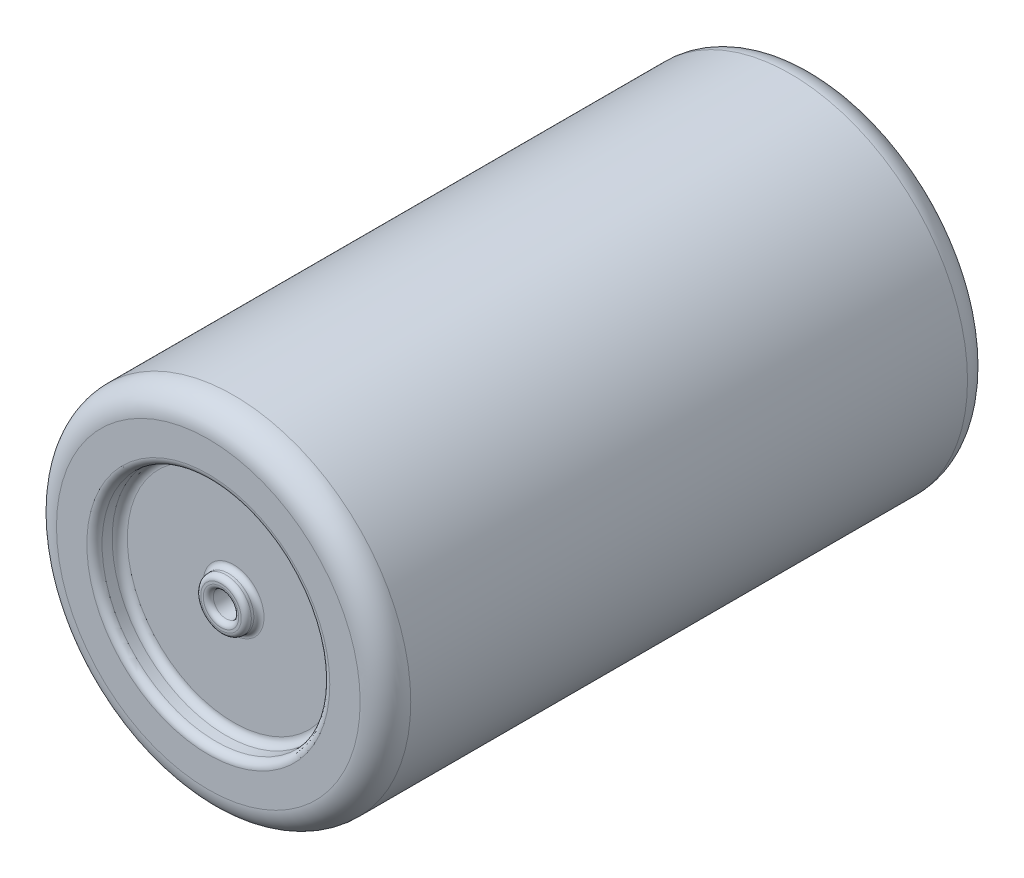
ISO-10303-21;
HEADER;
FILE_DESCRIPTION(('STEP AP214'),'2;1');
FILE_NAME('part.step','',(''),(''),'','','');
FILE_SCHEMA(('AUTOMOTIVE_DESIGN { 1 0 10303 214 1 1 1 1 }'));
ENDSEC;
DATA;
#1=APPLICATION_CONTEXT('core data for automotive mechanical design processes');
#2=APPLICATION_PROTOCOL_DEFINITION('international standard','automotive_design',2000,#1);
#3=PRODUCT_CONTEXT('',#1,'mechanical');
#4=PRODUCT('Part','Part','',(#3));
#5=PRODUCT_RELATED_PRODUCT_CATEGORY('part','',(#4));
#6=PRODUCT_DEFINITION_FORMATION('','',#4);
#7=PRODUCT_DEFINITION_CONTEXT('part definition',#1,'design');
#8=PRODUCT_DEFINITION('design','',#6,#7);
#9=PRODUCT_DEFINITION_SHAPE('','',#8);
#10=(LENGTH_UNIT() NAMED_UNIT(*) SI_UNIT(.MILLI.,.METRE.));
#11=(NAMED_UNIT(*) PLANE_ANGLE_UNIT() SI_UNIT($,.RADIAN.));
#12=(NAMED_UNIT(*) SI_UNIT($,.STERADIAN.) SOLID_ANGLE_UNIT());
#13=UNCERTAINTY_MEASURE_WITH_UNIT(LENGTH_MEASURE(1.E-05),#10,'distance_accuracy_value','');
#14=(GEOMETRIC_REPRESENTATION_CONTEXT(3) GLOBAL_UNCERTAINTY_ASSIGNED_CONTEXT((#13)) GLOBAL_UNIT_ASSIGNED_CONTEXT((#10,
#11,#12)) REPRESENTATION_CONTEXT('',''));
#15=CARTESIAN_POINT('',(0.,0.,0.));
#16=DIRECTION('',(0.,0.,1.));
#17=DIRECTION('',(1.,0.,0.));
#18=AXIS2_PLACEMENT_3D('',#15,#16,#17);
#19=CARTESIAN_POINT('',(0.,0.,6.));
#20=DIRECTION('',(0.,0.,-1.));
#21=DIRECTION('',(-1.,0.,0.));
#22=AXIS2_PLACEMENT_3D('',#19,#20,#21);
#23=CYLINDRICAL_SURFACE('',#22,3.5);
#24=CARTESIAN_POINT('',(0.,0.,-5.5));
#25=DIRECTION('',(0.,0.,1.));
#26=DIRECTION('',(1.,0.,0.));
#27=AXIS2_PLACEMENT_3D('',#24,#25,#26);
#28=CIRCLE('',#27,3.5);
#29=CARTESIAN_POINT('',(3.5,0.,-5.5));
#30=VERTEX_POINT('',#29);
#31=EDGE_CURVE('E145',#30,#30,#28,.T.);
#32=ORIENTED_EDGE('',*,*,#31,.T.);
#33=EDGE_LOOP('',(#32));
#34=FACE_BOUND('',#33,.T.);
#35=CARTESIAN_POINT('',(0.,0.,5.5));
#36=DIRECTION('',(0.,0.,1.));
#37=DIRECTION('',(1.,0.,0.));
#38=AXIS2_PLACEMENT_3D('',#35,#36,#37);
#39=CIRCLE('',#38,3.5);
#40=CARTESIAN_POINT('',(3.5,0.,5.5));
#41=VERTEX_POINT('',#40);
#42=EDGE_CURVE('E149',#41,#41,#39,.F.);
#43=ORIENTED_EDGE('',*,*,#42,.T.);
#44=EDGE_LOOP('',(#43));
#45=FACE_BOUND('',#44,.T.);
#46=ADVANCED_FACE('F41',(#34,#45),#23,.T.);
#47=CARTESIAN_POINT('',(0.,0.,6.));
#48=DIRECTION('',(0.,0.,1.));
#49=DIRECTION('',(1.,0.,0.));
#50=AXIS2_PLACEMENT_3D('',#47,#48,#49);
#51=PLANE('',#50);
#52=CARTESIAN_POINT('',(0.,0.,6.));
#53=DIRECTION('',(0.,0.,1.));
#54=DIRECTION('',(1.,0.,0.));
#55=AXIS2_PLACEMENT_3D('',#52,#53,#54);
#56=CIRCLE('',#55,2.4);
#57=CARTESIAN_POINT('',(2.4,0.,6.));
#58=VERTEX_POINT('',#57);
#59=EDGE_CURVE('E121',#58,#58,#56,.F.);
#60=ORIENTED_EDGE('',*,*,#59,.T.);
#61=EDGE_LOOP('',(#60));
#62=FACE_BOUND('',#61,.T.);
#63=CARTESIAN_POINT('',(0.,0.,6.));
#64=DIRECTION('',(0.,0.,1.));
#65=DIRECTION('',(1.,0.,0.));
#66=AXIS2_PLACEMENT_3D('',#63,#64,#65);
#67=CIRCLE('',#66,3.);
#68=CARTESIAN_POINT('',(3.,0.,6.));
#69=VERTEX_POINT('',#68);
#70=EDGE_CURVE('E137',#69,#69,#67,.T.);
#71=ORIENTED_EDGE('',*,*,#70,.T.);
#72=EDGE_LOOP('',(#71));
#73=FACE_BOUND('',#72,.T.);
#74=ADVANCED_FACE('F178',(#62,#73),#51,.T.);
#75=CARTESIAN_POINT('',(0.,0.,-6.));
#76=DIRECTION('',(0.,0.,1.));
#77=DIRECTION('',(1.,0.,0.));
#78=AXIS2_PLACEMENT_3D('',#75,#76,#77);
#79=PLANE('',#78);
#80=CARTESIAN_POINT('',(0.,0.,-6.));
#81=DIRECTION('',(0.,0.,1.));
#82=DIRECTION('',(1.,0.,0.));
#83=AXIS2_PLACEMENT_3D('',#80,#81,#82);
#84=CIRCLE('',#83,2.25);
#85=CARTESIAN_POINT('',(2.25,0.,-6.));
#86=VERTEX_POINT('',#85);
#87=EDGE_CURVE('E153',#86,#86,#84,.T.);
#88=ORIENTED_EDGE('',*,*,#87,.T.);
#89=EDGE_LOOP('',(#88));
#90=FACE_BOUND('',#89,.T.);
#91=CARTESIAN_POINT('',(0.,0.,-6.));
#92=DIRECTION('',(0.,0.,1.));
#93=DIRECTION('',(1.,0.,0.));
#94=AXIS2_PLACEMENT_3D('',#91,#92,#93);
#95=CIRCLE('',#94,3.);
#96=CARTESIAN_POINT('',(3.,0.,-6.));
#97=VERTEX_POINT('',#96);
#98=EDGE_CURVE('E141',#97,#97,#95,.F.);
#99=ORIENTED_EDGE('',*,*,#98,.T.);
#100=EDGE_LOOP('',(#99));
#101=FACE_BOUND('',#100,.T.);
#102=ADVANCED_FACE('F158',(#90,#101),#79,.F.);
#103=CARTESIAN_POINT('',(0.,0.,-5.5));
#104=DIRECTION('',(0.,0.,1.));
#105=DIRECTION('',(1.,0.,0.));
#106=AXIS2_PLACEMENT_3D('',#103,#104,#105);
#107=TOROIDAL_SURFACE('',#106,3.,0.5);
#108=ORIENTED_EDGE('',*,*,#98,.F.);
#109=EDGE_LOOP('',(#108));
#110=FACE_BOUND('',#109,.T.);
#111=ORIENTED_EDGE('',*,*,#31,.F.);
#112=EDGE_LOOP('',(#111));
#113=FACE_BOUND('',#112,.T.);
#114=ADVANCED_FACE('F189',(#110,#113),#107,.T.);
#115=CARTESIAN_POINT('',(0.,0.,5.5));
#116=DIRECTION('',(0.,0.,1.));
#117=DIRECTION('',(1.,0.,0.));
#118=AXIS2_PLACEMENT_3D('',#115,#116,#117);
#119=TOROIDAL_SURFACE('',#118,3.,0.5);
#120=ORIENTED_EDGE('',*,*,#42,.F.);
#121=EDGE_LOOP('',(#120));
#122=FACE_BOUND('',#121,.T.);
#123=ORIENTED_EDGE('',*,*,#70,.F.);
#124=EDGE_LOOP('',(#123));
#125=FACE_BOUND('',#124,.T.);
#126=ADVANCED_FACE('F192',(#122,#125),#119,.T.);
#127=CARTESIAN_POINT('',(0.,0.,5.5));
#128=DIRECTION('',(0.,0.,1.));
#129=DIRECTION('',(1.,0.,0.));
#130=AXIS2_PLACEMENT_3D('',#127,#128,#129);
#131=CYLINDRICAL_SURFACE('',#130,2.25);
#132=CARTESIAN_POINT('',(0.,0.,5.65));
#133=DIRECTION('',(0.,0.,1.));
#134=DIRECTION('',(1.,0.,0.));
#135=AXIS2_PLACEMENT_3D('',#132,#133,#134);
#136=CIRCLE('',#135,2.25);
#137=CARTESIAN_POINT('',(2.25,0.,5.65));
#138=VERTEX_POINT('',#137);
#139=EDGE_CURVE('E125',#138,#138,#136,.F.);
#140=ORIENTED_EDGE('',*,*,#139,.T.);
#141=EDGE_LOOP('',(#140));
#142=FACE_BOUND('',#141,.T.);
#143=CARTESIAN_POINT('',(0.,0.,5.85));
#144=DIRECTION('',(0.,0.,1.));
#145=DIRECTION('',(1.,0.,0.));
#146=AXIS2_PLACEMENT_3D('',#143,#144,#145);
#147=CIRCLE('',#146,2.25);
#148=CARTESIAN_POINT('',(2.25,0.,5.85));
#149=VERTEX_POINT('',#148);
#150=EDGE_CURVE('E129',#149,#149,#147,.T.);
#151=ORIENTED_EDGE('',*,*,#150,.T.);
#152=EDGE_LOOP('',(#151));
#153=FACE_BOUND('',#152,.T.);
#154=ADVANCED_FACE('F196',(#142,#153),#131,.F.);
#155=CARTESIAN_POINT('',(0.,0.,5.5));
#156=DIRECTION('',(0.,0.,1.));
#157=DIRECTION('',(1.,0.,0.));
#158=AXIS2_PLACEMENT_3D('',#155,#156,#157);
#159=PLANE('',#158);
#160=CARTESIAN_POINT('',(0.,0.,5.5));
#161=DIRECTION('',(0.,0.,1.));
#162=DIRECTION('',(1.,0.,0.));
#163=AXIS2_PLACEMENT_3D('',#160,#161,#162);
#164=CIRCLE('',#163,0.6);
#165=CARTESIAN_POINT('',(0.6,0.,5.5));
#166=VERTEX_POINT('',#165);
#167=EDGE_CURVE('E89',#166,#166,#164,.F.);
#168=ORIENTED_EDGE('',*,*,#167,.T.);
#169=EDGE_LOOP('',(#168));
#170=FACE_BOUND('',#169,.T.);
#171=CARTESIAN_POINT('',(0.,0.,5.5));
#172=DIRECTION('',(0.,0.,1.));
#173=DIRECTION('',(1.,0.,0.));
#174=AXIS2_PLACEMENT_3D('',#171,#172,#173);
#175=CIRCLE('',#174,2.1);
#176=CARTESIAN_POINT('',(2.1,0.,5.5));
#177=VERTEX_POINT('',#176);
#178=EDGE_CURVE('E133',#177,#177,#175,.T.);
#179=ORIENTED_EDGE('',*,*,#178,.T.);
#180=EDGE_LOOP('',(#179));
#181=FACE_BOUND('',#180,.T.);
#182=ADVANCED_FACE('F410',(#170,#181),#159,.T.);
#183=CARTESIAN_POINT('',(0.,0.,5.75));
#184=DIRECTION('',(0.,0.,-1.));
#185=DIRECTION('',(-1.,0.,0.));
#186=AXIS2_PLACEMENT_3D('',#183,#184,#185);
#187=CYLINDRICAL_SURFACE('',#186,0.5);
#188=CARTESIAN_POINT('',(0.,0.,5.65));
#189=DIRECTION('',(0.,0.,1.));
#190=DIRECTION('',(1.,0.,0.));
#191=AXIS2_PLACEMENT_3D('',#188,#189,#190);
#192=CIRCLE('',#191,0.5);
#193=CARTESIAN_POINT('',(0.5,0.,5.65));
#194=VERTEX_POINT('',#193);
#195=EDGE_CURVE('E105',#194,#194,#192,.F.);
#196=ORIENTED_EDGE('',*,*,#195,.T.);
#197=EDGE_LOOP('',(#196));
#198=FACE_BOUND('',#197,.T.);
#199=CARTESIAN_POINT('',(0.,0.,5.6));
#200=DIRECTION('',(0.,0.,1.));
#201=DIRECTION('',(1.,0.,0.));
#202=AXIS2_PLACEMENT_3D('',#199,#200,#201);
#203=CIRCLE('',#202,0.5);
#204=CARTESIAN_POINT('',(0.5,0.,5.6));
#205=VERTEX_POINT('',#204);
#206=EDGE_CURVE('E109',#205,#205,#203,.T.);
#207=ORIENTED_EDGE('',*,*,#206,.T.);
#208=EDGE_LOOP('',(#207));
#209=FACE_BOUND('',#208,.T.);
#210=ADVANCED_FACE('F400',(#198,#209),#187,.T.);
#211=CARTESIAN_POINT('',(0.,0.,5.75));
#212=DIRECTION('',(0.,0.,1.));
#213=DIRECTION('',(1.,0.,0.));
#214=AXIS2_PLACEMENT_3D('',#211,#212,#213);
#215=PLANE('',#214);
#216=CARTESIAN_POINT('',(0.,0.,5.75));
#217=DIRECTION('',(0.,0.,1.));
#218=DIRECTION('',(1.,0.,0.));
#219=AXIS2_PLACEMENT_3D('',#216,#217,#218);
#220=CIRCLE('',#219,0.4);
#221=CARTESIAN_POINT('',(0.4,0.,5.75));
#222=VERTEX_POINT('',#221);
#223=EDGE_CURVE('E113',#222,#222,#220,.T.);
#224=ORIENTED_EDGE('',*,*,#223,.T.);
#225=EDGE_LOOP('',(#224));
#226=FACE_BOUND('',#225,.T.);
#227=CARTESIAN_POINT('',(0.,0.,5.75));
#228=DIRECTION('',(0.,0.,1.));
#229=DIRECTION('',(1.,0.,0.));
#230=AXIS2_PLACEMENT_3D('',#227,#228,#229);
#231=CIRCLE('',#230,0.35);
#232=CARTESIAN_POINT('',(0.35,0.,5.75));
#233=VERTEX_POINT('',#232);
#234=EDGE_CURVE('E117',#233,#233,#231,.F.);
#235=ORIENTED_EDGE('',*,*,#234,.T.);
#236=EDGE_LOOP('',(#235));
#237=FACE_BOUND('',#236,.T.);
#238=ADVANCED_FACE('F390',(#226,#237),#215,.T.);
#239=CARTESIAN_POINT('',(0.,0.,5.25));
#240=DIRECTION('',(0.,0.,1.));
#241=DIRECTION('',(1.,0.,0.));
#242=AXIS2_PLACEMENT_3D('',#239,#240,#241);
#243=CYLINDRICAL_SURFACE('',#242,0.25);
#244=CARTESIAN_POINT('',(0.,0.,5.65));
#245=DIRECTION('',(0.,0.,1.));
#246=DIRECTION('',(1.,0.,0.));
#247=AXIS2_PLACEMENT_3D('',#244,#245,#246);
#248=CIRCLE('',#247,0.25);
#249=CARTESIAN_POINT('',(0.25,0.,5.65));
#250=VERTEX_POINT('',#249);
#251=EDGE_CURVE('E97',#250,#250,#248,.T.);
#252=ORIENTED_EDGE('',*,*,#251,.T.);
#253=EDGE_LOOP('',(#252));
#254=FACE_BOUND('',#253,.T.);
#255=CARTESIAN_POINT('',(0.,0.,5.35));
#256=DIRECTION('',(0.,0.,1.));
#257=DIRECTION('',(1.,0.,0.));
#258=AXIS2_PLACEMENT_3D('',#255,#256,#257);
#259=CIRCLE('',#258,0.25);
#260=CARTESIAN_POINT('',(0.25,0.,5.35));
#261=VERTEX_POINT('',#260);
#262=EDGE_CURVE('E101',#261,#261,#259,.F.);
#263=ORIENTED_EDGE('',*,*,#262,.T.);
#264=EDGE_LOOP('',(#263));
#265=FACE_BOUND('',#264,.T.);
#266=ADVANCED_FACE('F381',(#254,#265),#243,.F.);
#267=CARTESIAN_POINT('',(0.,0.,5.25));
#268=DIRECTION('',(0.,0.,1.));
#269=DIRECTION('',(1.,0.,0.));
#270=AXIS2_PLACEMENT_3D('',#267,#268,#269);
#271=PLANE('',#270);
#272=CARTESIAN_POINT('',(0.,0.,5.25));
#273=DIRECTION('',(0.,0.,1.));
#274=DIRECTION('',(1.,0.,0.));
#275=AXIS2_PLACEMENT_3D('',#272,#273,#274);
#276=CIRCLE('',#275,0.15);
#277=CARTESIAN_POINT('',(0.15,0.,5.25));
#278=VERTEX_POINT('',#277);
#279=EDGE_CURVE('E93',#278,#278,#276,.T.);
#280=ORIENTED_EDGE('',*,*,#279,.T.);
#281=EDGE_LOOP('',(#280));
#282=FACE_BOUND('',#281,.T.);
#283=ADVANCED_FACE('F202',(#282),#271,.T.);
#284=CARTESIAN_POINT('',(0.,0.,5.65));
#285=DIRECTION('',(0.,0.,1.));
#286=DIRECTION('',(1.,0.,0.));
#287=AXIS2_PLACEMENT_3D('',#284,#285,#286);
#288=TOROIDAL_SURFACE('',#287,2.1,0.15);
#289=ORIENTED_EDGE('',*,*,#139,.F.);
#290=EDGE_LOOP('',(#289));
#291=FACE_BOUND('',#290,.T.);
#292=ORIENTED_EDGE('',*,*,#178,.F.);
#293=EDGE_LOOP('',(#292));
#294=FACE_BOUND('',#293,.T.);
#295=ADVANCED_FACE('F198',(#291,#294),#288,.F.);
#296=CARTESIAN_POINT('',(0.,0.,5.85));
#297=DIRECTION('',(0.,0.,1.));
#298=DIRECTION('',(1.,0.,0.));
#299=AXIS2_PLACEMENT_3D('',#296,#297,#298);
#300=TOROIDAL_SURFACE('',#299,2.4,0.15);
#301=ORIENTED_EDGE('',*,*,#59,.F.);
#302=EDGE_LOOP('',(#301));
#303=FACE_BOUND('',#302,.T.);
#304=ORIENTED_EDGE('',*,*,#150,.F.);
#305=EDGE_LOOP('',(#304));
#306=FACE_BOUND('',#305,.T.);
#307=ADVANCED_FACE('F201',(#303,#306),#300,.T.);
#308=CARTESIAN_POINT('',(0.,0.,5.65));
#309=DIRECTION('',(0.,0.,1.));
#310=DIRECTION('',(1.,0.,0.));
#311=AXIS2_PLACEMENT_3D('',#308,#309,#310);
#312=TOROIDAL_SURFACE('',#311,0.4,0.1);
#313=ORIENTED_EDGE('',*,*,#195,.F.);
#314=EDGE_LOOP('',(#313));
#315=FACE_BOUND('',#314,.T.);
#316=ORIENTED_EDGE('',*,*,#223,.F.);
#317=EDGE_LOOP('',(#316));
#318=FACE_BOUND('',#317,.T.);
#319=ADVANCED_FACE('F206',(#315,#318),#312,.T.);
#320=CARTESIAN_POINT('',(0.,0.,5.65));
#321=DIRECTION('',(0.,0.,1.));
#322=DIRECTION('',(1.,0.,0.));
#323=AXIS2_PLACEMENT_3D('',#320,#321,#322);
#324=TOROIDAL_SURFACE('',#323,0.35,0.1);
#325=ORIENTED_EDGE('',*,*,#234,.F.);
#326=EDGE_LOOP('',(#325));
#327=FACE_BOUND('',#326,.T.);
#328=ORIENTED_EDGE('',*,*,#251,.F.);
#329=EDGE_LOOP('',(#328));
#330=FACE_BOUND('',#329,.T.);
#331=ADVANCED_FACE('F210',(#327,#330),#324,.T.);
#332=CARTESIAN_POINT('',(0.,0.,5.35));
#333=DIRECTION('',(0.,0.,1.));
#334=DIRECTION('',(1.,0.,0.));
#335=AXIS2_PLACEMENT_3D('',#332,#333,#334);
#336=TOROIDAL_SURFACE('',#335,0.15,0.1);
#337=ORIENTED_EDGE('',*,*,#262,.F.);
#338=EDGE_LOOP('',(#337));
#339=FACE_BOUND('',#338,.T.);
#340=ORIENTED_EDGE('',*,*,#279,.F.);
#341=EDGE_LOOP('',(#340));
#342=FACE_BOUND('',#341,.T.);
#343=ADVANCED_FACE('F173',(#339,#342),#336,.F.);
#344=CARTESIAN_POINT('',(0.,0.,5.6));
#345=DIRECTION('',(0.,0.,1.));
#346=DIRECTION('',(1.,0.,0.));
#347=AXIS2_PLACEMENT_3D('',#344,#345,#346);
#348=TOROIDAL_SURFACE('',#347,0.6,0.1);
#349=ORIENTED_EDGE('',*,*,#206,.F.);
#350=EDGE_LOOP('',(#349));
#351=FACE_BOUND('',#350,.T.);
#352=ORIENTED_EDGE('',*,*,#167,.F.);
#353=EDGE_LOOP('',(#352));
#354=FACE_BOUND('',#353,.T.);
#355=ADVANCED_FACE('F164',(#351,#354),#348,.F.);
#356=CARTESIAN_POINT('',(0.,0.,-5.5));
#357=DIRECTION('',(0.,0.,-1.));
#358=DIRECTION('',(-1.,0.,0.));
#359=AXIS2_PLACEMENT_3D('',#356,#357,#358);
#360=CYLINDRICAL_SURFACE('',#359,2.25);
#361=CARTESIAN_POINT('',(0.,0.,-5.65));
#362=DIRECTION('',(0.,0.,-1.));
#363=DIRECTION('',(-1.,0.,0.));
#364=AXIS2_PLACEMENT_3D('',#361,#362,#363);
#365=CIRCLE('',#364,2.25);
#366=CARTESIAN_POINT('',(-2.25,0.,-5.65));
#367=VERTEX_POINT('',#366);
#368=EDGE_CURVE('E85',#367,#367,#365,.F.);
#369=ORIENTED_EDGE('',*,*,#368,.T.);
#370=EDGE_LOOP('',(#369));
#371=FACE_BOUND('',#370,.T.);
#372=ORIENTED_EDGE('',*,*,#87,.F.);
#373=EDGE_LOOP('',(#372));
#374=FACE_BOUND('',#373,.T.);
#375=ADVANCED_FACE('F161',(#371,#374),#360,.F.);
#376=CARTESIAN_POINT('',(0.,0.,-5.5));
#377=DIRECTION('',(0.,0.,-1.));
#378=DIRECTION('',(1.,0.,0.));
#379=AXIS2_PLACEMENT_3D('',#376,#377,#378);
#380=PLANE('',#379);
#381=CARTESIAN_POINT('',(0.,0.,-5.5));
#382=DIRECTION('',(0.,0.,-1.));
#383=DIRECTION('',(-1.,0.,0.));
#384=AXIS2_PLACEMENT_3D('',#381,#382,#383);
#385=CIRCLE('',#384,0.6);
#386=CARTESIAN_POINT('',(-0.6,0.,-5.5));
#387=VERTEX_POINT('',#386);
#388=EDGE_CURVE('E10',#387,#387,#385,.F.);
#389=ORIENTED_EDGE('',*,*,#388,.T.);
#390=EDGE_LOOP('',(#389));
#391=FACE_BOUND('',#390,.T.);
#392=CARTESIAN_POINT('',(0.,0.,-5.5));
#393=DIRECTION('',(0.,0.,-1.));
#394=DIRECTION('',(-1.,0.,0.));
#395=AXIS2_PLACEMENT_3D('',#392,#393,#394);
#396=CIRCLE('',#395,2.1);
#397=CARTESIAN_POINT('',(-2.1,0.,-5.5));
#398=VERTEX_POINT('',#397);
#399=EDGE_CURVE('E81',#398,#398,#396,.T.);
#400=ORIENTED_EDGE('',*,*,#399,.T.);
#401=EDGE_LOOP('',(#400));
#402=FACE_BOUND('',#401,.T.);
#403=ADVANCED_FACE('F163',(#391,#402),#380,.T.);
#404=CARTESIAN_POINT('',(0.,0.,-5.75));
#405=DIRECTION('',(0.,0.,1.));
#406=DIRECTION('',(1.,0.,0.));
#407=AXIS2_PLACEMENT_3D('',#404,#405,#406);
#408=CYLINDRICAL_SURFACE('',#407,0.5);
#409=CARTESIAN_POINT('',(0.,0.,-5.65));
#410=DIRECTION('',(0.,0.,-1.));
#411=DIRECTION('',(-1.,0.,0.));
#412=AXIS2_PLACEMENT_3D('',#409,#410,#411);
#413=CIRCLE('',#412,0.5);
#414=CARTESIAN_POINT('',(-0.5,0.,-5.65));
#415=VERTEX_POINT('',#414);
#416=EDGE_CURVE('E73',#415,#415,#413,.F.);
#417=ORIENTED_EDGE('',*,*,#416,.T.);
#418=EDGE_LOOP('',(#417));
#419=FACE_BOUND('',#418,.T.);
#420=CARTESIAN_POINT('',(0.,0.,-5.6));
#421=DIRECTION('',(0.,0.,-1.));
#422=DIRECTION('',(-1.,0.,0.));
#423=AXIS2_PLACEMENT_3D('',#420,#421,#422);
#424=CIRCLE('',#423,0.5);
#425=CARTESIAN_POINT('',(-0.5,0.,-5.6));
#426=VERTEX_POINT('',#425);
#427=EDGE_CURVE('E77',#426,#426,#424,.T.);
#428=ORIENTED_EDGE('',*,*,#427,.T.);
#429=EDGE_LOOP('',(#428));
#430=FACE_BOUND('',#429,.T.);
#431=ADVANCED_FACE('F171',(#419,#430),#408,.T.);
#432=CARTESIAN_POINT('',(0.,0.,-5.75));
#433=DIRECTION('',(0.,0.,-1.));
#434=DIRECTION('',(1.,0.,0.));
#435=AXIS2_PLACEMENT_3D('',#432,#433,#434);
#436=PLANE('',#435);
#437=CARTESIAN_POINT('',(0.,0.,-5.75));
#438=DIRECTION('',(0.,0.,-1.));
#439=DIRECTION('',(-1.,0.,0.));
#440=AXIS2_PLACEMENT_3D('',#437,#438,#439);
#441=CIRCLE('',#440,0.4);
#442=CARTESIAN_POINT('',(-0.4,0.,-5.75));
#443=VERTEX_POINT('',#442);
#444=EDGE_CURVE('E65',#443,#443,#441,.T.);
#445=ORIENTED_EDGE('',*,*,#444,.T.);
#446=EDGE_LOOP('',(#445));
#447=FACE_BOUND('',#446,.T.);
#448=CARTESIAN_POINT('',(0.,0.,-5.75));
#449=DIRECTION('',(0.,0.,-1.));
#450=DIRECTION('',(-1.,0.,0.));
#451=AXIS2_PLACEMENT_3D('',#448,#449,#450);
#452=CIRCLE('',#451,0.35);
#453=CARTESIAN_POINT('',(-0.35,0.,-5.75));
#454=VERTEX_POINT('',#453);
#455=EDGE_CURVE('E69',#454,#454,#452,.F.);
#456=ORIENTED_EDGE('',*,*,#455,.T.);
#457=EDGE_LOOP('',(#456));
#458=FACE_BOUND('',#457,.T.);
#459=ADVANCED_FACE('F242',(#447,#458),#436,.T.);
#460=CARTESIAN_POINT('',(0.,0.,-5.25));
#461=DIRECTION('',(0.,0.,-1.));
#462=DIRECTION('',(-1.,0.,0.));
#463=AXIS2_PLACEMENT_3D('',#460,#461,#462);
#464=CYLINDRICAL_SURFACE('',#463,0.25);
#465=CARTESIAN_POINT('',(0.,0.,-5.65));
#466=DIRECTION('',(0.,0.,-1.));
#467=DIRECTION('',(-1.,0.,0.));
#468=AXIS2_PLACEMENT_3D('',#465,#466,#467);
#469=CIRCLE('',#468,0.25);
#470=CARTESIAN_POINT('',(-0.25,0.,-5.65));
#471=VERTEX_POINT('',#470);
#472=EDGE_CURVE('E54',#471,#471,#469,.T.);
#473=ORIENTED_EDGE('',*,*,#472,.T.);
#474=EDGE_LOOP('',(#473));
#475=FACE_BOUND('',#474,.T.);
#476=CARTESIAN_POINT('',(0.,0.,-5.35));
#477=DIRECTION('',(0.,0.,-1.));
#478=DIRECTION('',(-1.,0.,0.));
#479=AXIS2_PLACEMENT_3D('',#476,#477,#478);
#480=CIRCLE('',#479,0.25);
#481=CARTESIAN_POINT('',(-0.25,0.,-5.35));
#482=VERTEX_POINT('',#481);
#483=EDGE_CURVE('E59',#482,#482,#480,.F.);
#484=ORIENTED_EDGE('',*,*,#483,.T.);
#485=EDGE_LOOP('',(#484));
#486=FACE_BOUND('',#485,.T.);
#487=ADVANCED_FACE('F240',(#475,#486),#464,.F.);
#488=CARTESIAN_POINT('',(0.,0.,-5.25));
#489=DIRECTION('',(0.,0.,-1.));
#490=DIRECTION('',(1.,0.,0.));
#491=AXIS2_PLACEMENT_3D('',#488,#489,#490);
#492=PLANE('',#491);
#493=CARTESIAN_POINT('',(0.,0.,-5.25));
#494=DIRECTION('',(0.,0.,-1.));
#495=DIRECTION('',(-1.,0.,0.));
#496=AXIS2_PLACEMENT_3D('',#493,#494,#495);
#497=CIRCLE('',#496,0.15);
#498=CARTESIAN_POINT('',(-0.15,0.,-5.25));
#499=VERTEX_POINT('',#498);
#500=EDGE_CURVE('E49',#499,#499,#497,.T.);
#501=ORIENTED_EDGE('',*,*,#500,.T.);
#502=EDGE_LOOP('',(#501));
#503=FACE_BOUND('',#502,.T.);
#504=ADVANCED_FACE('F222',(#503),#492,.T.);
#505=CARTESIAN_POINT('',(0.,0.,-5.65));
#506=DIRECTION('',(0.,0.,-1.));
#507=DIRECTION('',(-1.,0.,0.));
#508=AXIS2_PLACEMENT_3D('',#505,#506,#507);
#509=TOROIDAL_SURFACE('',#508,2.1,0.15);
#510=ORIENTED_EDGE('',*,*,#399,.F.);
#511=EDGE_LOOP('',(#510));
#512=FACE_BOUND('',#511,.T.);
#513=ORIENTED_EDGE('',*,*,#368,.F.);
#514=EDGE_LOOP('',(#513));
#515=FACE_BOUND('',#514,.T.);
#516=ADVANCED_FACE('F218',(#512,#515),#509,.F.);
#517=CARTESIAN_POINT('',(0.,0.,-5.65));
#518=DIRECTION('',(0.,0.,-1.));
#519=DIRECTION('',(-1.,0.,0.));
#520=AXIS2_PLACEMENT_3D('',#517,#518,#519);
#521=TOROIDAL_SURFACE('',#520,0.4,0.1);
#522=ORIENTED_EDGE('',*,*,#444,.F.);
#523=EDGE_LOOP('',(#522));
#524=FACE_BOUND('',#523,.T.);
#525=ORIENTED_EDGE('',*,*,#416,.F.);
#526=EDGE_LOOP('',(#525));
#527=FACE_BOUND('',#526,.T.);
#528=ADVANCED_FACE('F221',(#524,#527),#521,.T.);
#529=CARTESIAN_POINT('',(0.,0.,-5.65));
#530=DIRECTION('',(0.,0.,-1.));
#531=DIRECTION('',(-1.,0.,0.));
#532=AXIS2_PLACEMENT_3D('',#529,#530,#531);
#533=TOROIDAL_SURFACE('',#532,0.35,0.1);
#534=ORIENTED_EDGE('',*,*,#472,.F.);
#535=EDGE_LOOP('',(#534));
#536=FACE_BOUND('',#535,.T.);
#537=ORIENTED_EDGE('',*,*,#455,.F.);
#538=EDGE_LOOP('',(#537));
#539=FACE_BOUND('',#538,.T.);
#540=ADVANCED_FACE('F226',(#536,#539),#533,.T.);
#541=CARTESIAN_POINT('',(0.,0.,-5.35));
#542=DIRECTION('',(0.,0.,-1.));
#543=DIRECTION('',(-1.,0.,0.));
#544=AXIS2_PLACEMENT_3D('',#541,#542,#543);
#545=TOROIDAL_SURFACE('',#544,0.15,0.1);
#546=ORIENTED_EDGE('',*,*,#500,.F.);
#547=EDGE_LOOP('',(#546));
#548=FACE_BOUND('',#547,.T.);
#549=ORIENTED_EDGE('',*,*,#483,.F.);
#550=EDGE_LOOP('',(#549));
#551=FACE_BOUND('',#550,.T.);
#552=ADVANCED_FACE('F229',(#548,#551),#545,.F.);
#553=CARTESIAN_POINT('',(0.,0.,-5.6));
#554=DIRECTION('',(0.,0.,-1.));
#555=DIRECTION('',(-1.,0.,0.));
#556=AXIS2_PLACEMENT_3D('',#553,#554,#555);
#557=TOROIDAL_SURFACE('',#556,0.6,0.1);
#558=ORIENTED_EDGE('',*,*,#388,.F.);
#559=EDGE_LOOP('',(#558));
#560=FACE_BOUND('',#559,.T.);
#561=ORIENTED_EDGE('',*,*,#427,.F.);
#562=EDGE_LOOP('',(#561));
#563=FACE_BOUND('',#562,.T.);
#564=ADVANCED_FACE('F43',(#560,#563),#557,.F.);
#565=CLOSED_SHELL('',(#46,#74,#102,#114,#126,#154,#182,#210,#238,#266,#283,#295,#307,#319,#331,
#343,#355,#375,#403,#431,#459,#487,#504,#516,#528,#540,#552,#564));
#566=MANIFOLD_SOLID_BREP('B2',#565);
#567=ADVANCED_BREP_SHAPE_REPRESENTATION('',(#18,#566),#14);
#568=SHAPE_DEFINITION_REPRESENTATION(#9,#567);
ENDSEC;
END-ISO-10303-21;
